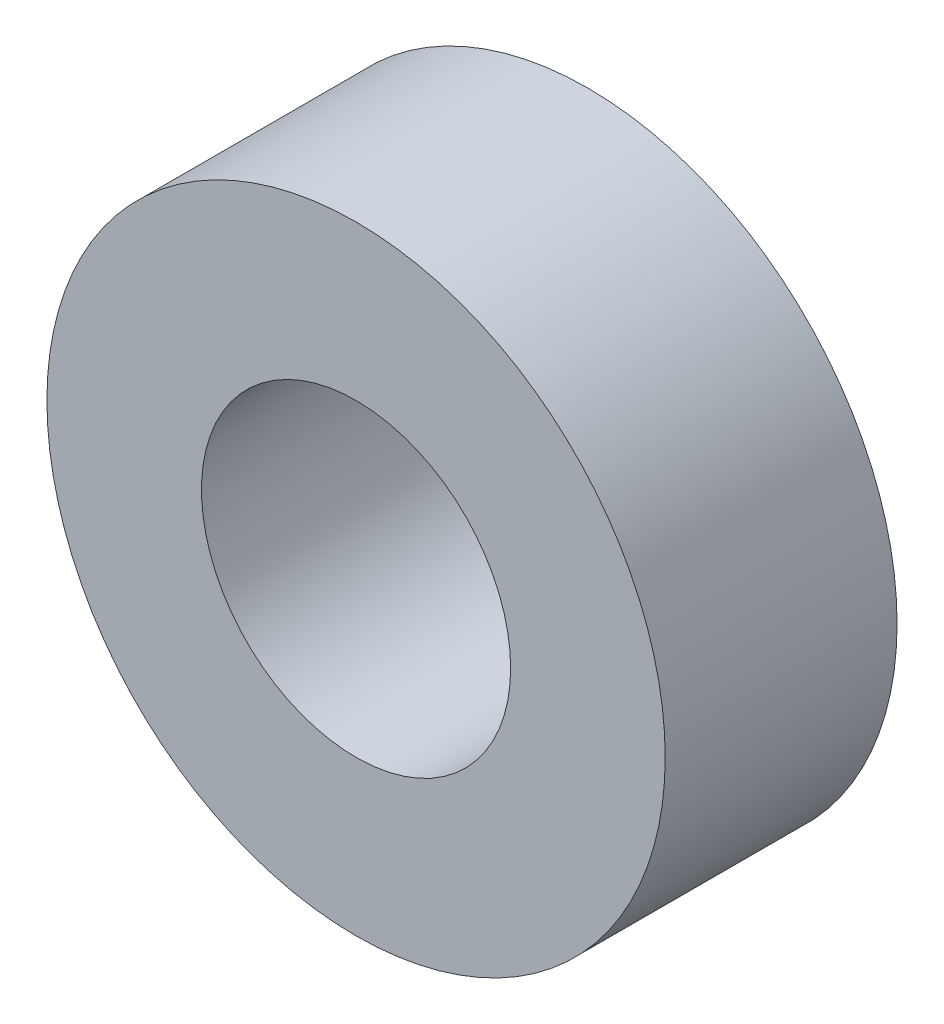
ISO-10303-21;
HEADER;
FILE_DESCRIPTION(('STEP AP214'),'2;1');
FILE_NAME('part.step','',(''),(''),'','','');
FILE_SCHEMA(('AUTOMOTIVE_DESIGN { 1 0 10303 214 1 1 1 1 }'));
ENDSEC;
DATA;
#1=APPLICATION_CONTEXT('core data for automotive mechanical design processes');
#2=APPLICATION_PROTOCOL_DEFINITION('international standard','automotive_design',2000,#1);
#3=PRODUCT_CONTEXT('',#1,'mechanical');
#4=PRODUCT('Part','Part','',(#3));
#5=PRODUCT_RELATED_PRODUCT_CATEGORY('part','',(#4));
#6=PRODUCT_DEFINITION_FORMATION('','',#4);
#7=PRODUCT_DEFINITION_CONTEXT('part definition',#1,'design');
#8=PRODUCT_DEFINITION('design','',#6,#7);
#9=PRODUCT_DEFINITION_SHAPE('','',#8);
#10=(LENGTH_UNIT() NAMED_UNIT(*) SI_UNIT(.MILLI.,.METRE.));
#11=(NAMED_UNIT(*) PLANE_ANGLE_UNIT() SI_UNIT($,.RADIAN.));
#12=(NAMED_UNIT(*) SI_UNIT($,.STERADIAN.) SOLID_ANGLE_UNIT());
#13=UNCERTAINTY_MEASURE_WITH_UNIT(LENGTH_MEASURE(1.E-05),#10,'distance_accuracy_value','');
#14=(GEOMETRIC_REPRESENTATION_CONTEXT(3) GLOBAL_UNCERTAINTY_ASSIGNED_CONTEXT((#13)) GLOBAL_UNIT_ASSIGNED_CONTEXT((#10,
#11,#12)) REPRESENTATION_CONTEXT('',''));
#15=CARTESIAN_POINT('',(0.,0.,0.));
#16=DIRECTION('',(0.,0.,1.));
#17=DIRECTION('',(1.,0.,0.));
#18=AXIS2_PLACEMENT_3D('',#15,#16,#17);
#19=CARTESIAN_POINT('',(0.,0.,3.));
#20=DIRECTION('',(0.,0.,1.));
#21=DIRECTION('',(1.,0.,0.));
#22=AXIS2_PLACEMENT_3D('',#19,#20,#21);
#23=PLANE('',#22);
#24=CARTESIAN_POINT('',(0.,0.,3.));
#25=DIRECTION('',(0.,0.,1.));
#26=DIRECTION('',(1.,0.,0.));
#27=AXIS2_PLACEMENT_3D('',#24,#25,#26);
#28=CIRCLE('',#27,4.);
#29=CARTESIAN_POINT('',(4.,0.,3.));
#30=VERTEX_POINT('',#29);
#31=EDGE_CURVE('E10',#30,#30,#28,.T.);
#32=ORIENTED_EDGE('',*,*,#31,.T.);
#33=EDGE_LOOP('',(#32));
#34=FACE_BOUND('',#33,.T.);
#35=CARTESIAN_POINT('',(0.,0.,3.));
#36=DIRECTION('',(0.,0.,1.));
#37=DIRECTION('',(1.,0.,0.));
#38=AXIS2_PLACEMENT_3D('',#35,#36,#37);
#39=CIRCLE('',#38,2.);
#40=CARTESIAN_POINT('',(2.,0.,3.));
#41=VERTEX_POINT('',#40);
#42=EDGE_CURVE('E41',#41,#41,#39,.T.);
#43=ORIENTED_EDGE('',*,*,#42,.F.);
#44=EDGE_LOOP('',(#43));
#45=FACE_BOUND('',#44,.T.);
#46=ADVANCED_FACE('F30',(#34,#45),#23,.T.);
#47=CARTESIAN_POINT('',(0.,0.,0.));
#48=DIRECTION('',(0.,0.,1.));
#49=DIRECTION('',(1.,0.,0.));
#50=AXIS2_PLACEMENT_3D('',#47,#48,#49);
#51=PLANE('',#50);
#52=CARTESIAN_POINT('',(0.,0.,0.));
#53=DIRECTION('',(0.,0.,1.));
#54=DIRECTION('',(1.,0.,0.));
#55=AXIS2_PLACEMENT_3D('',#52,#53,#54);
#56=CIRCLE('',#55,4.);
#57=CARTESIAN_POINT('',(4.,0.,0.));
#58=VERTEX_POINT('',#57);
#59=EDGE_CURVE('E34',#58,#58,#56,.T.);
#60=ORIENTED_EDGE('',*,*,#59,.F.);
#61=EDGE_LOOP('',(#60));
#62=FACE_BOUND('',#61,.T.);
#63=CARTESIAN_POINT('',(0.,0.,0.));
#64=DIRECTION('',(0.,0.,1.));
#65=DIRECTION('',(1.,0.,0.));
#66=AXIS2_PLACEMENT_3D('',#63,#64,#65);
#67=CIRCLE('',#66,2.);
#68=CARTESIAN_POINT('',(2.,0.,0.));
#69=VERTEX_POINT('',#68);
#70=EDGE_CURVE('E43',#69,#69,#67,.T.);
#71=ORIENTED_EDGE('',*,*,#70,.T.);
#72=EDGE_LOOP('',(#71));
#73=FACE_BOUND('',#72,.T.);
#74=ADVANCED_FACE('F53',(#62,#73),#51,.F.);
#75=CARTESIAN_POINT('',(0.,0.,3.));
#76=DIRECTION('',(0.,0.,-1.));
#77=DIRECTION('',(-1.,0.,0.));
#78=AXIS2_PLACEMENT_3D('',#75,#76,#77);
#79=CYLINDRICAL_SURFACE('',#78,4.);
#80=ORIENTED_EDGE('',*,*,#31,.F.);
#81=EDGE_LOOP('',(#80));
#82=FACE_BOUND('',#81,.T.);
#83=ORIENTED_EDGE('',*,*,#59,.T.);
#84=EDGE_LOOP('',(#83));
#85=FACE_BOUND('',#84,.T.);
#86=ADVANCED_FACE('F32',(#82,#85),#79,.T.);
#87=CARTESIAN_POINT('',(0.,0.,3.));
#88=DIRECTION('',(0.,0.,-1.));
#89=DIRECTION('',(-1.,0.,0.));
#90=AXIS2_PLACEMENT_3D('',#87,#88,#89);
#91=CYLINDRICAL_SURFACE('',#90,2.);
#92=ORIENTED_EDGE('',*,*,#42,.T.);
#93=EDGE_LOOP('',(#92));
#94=FACE_BOUND('',#93,.T.);
#95=ORIENTED_EDGE('',*,*,#70,.F.);
#96=EDGE_LOOP('',(#95));
#97=FACE_BOUND('',#96,.T.);
#98=ADVANCED_FACE('F49',(#94,#97),#91,.F.);
#99=CLOSED_SHELL('',(#46,#74,#86,#98));
#100=MANIFOLD_SOLID_BREP('B2',#99);
#101=ADVANCED_BREP_SHAPE_REPRESENTATION('',(#18,#100),#14);
#102=SHAPE_DEFINITION_REPRESENTATION(#9,#101);
ENDSEC;
END-ISO-10303-21;
